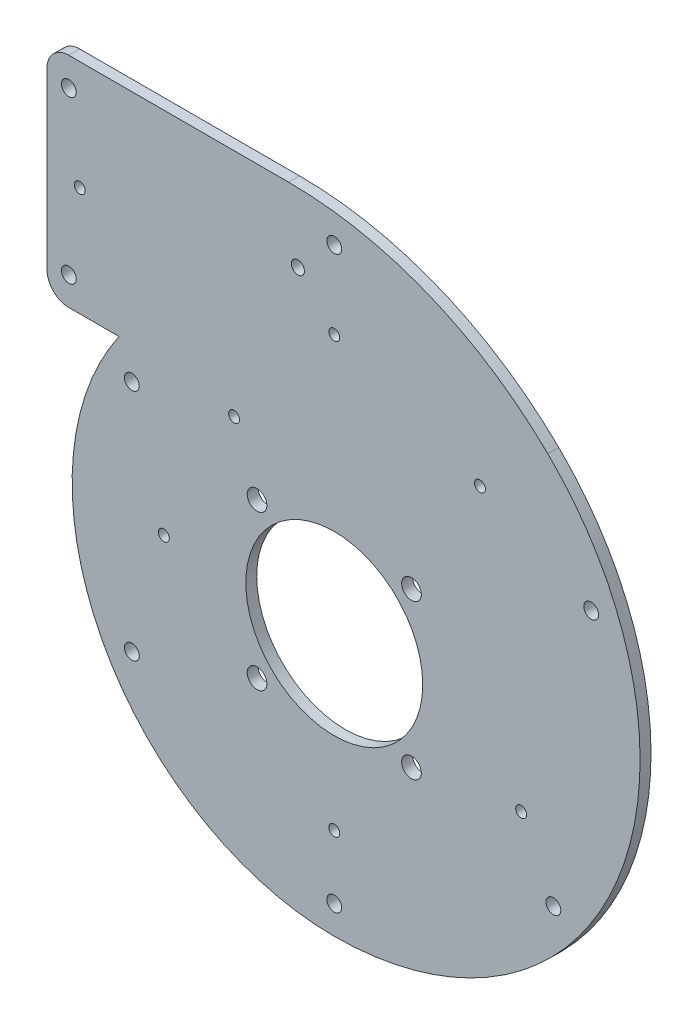
ISO-10303-21;
HEADER;
FILE_DESCRIPTION(('STEP AP214'),'2;1');
FILE_NAME('part.step','',(''),(''),'','','');
FILE_SCHEMA(('AUTOMOTIVE_DESIGN { 1 0 10303 214 1 1 1 1 }'));
ENDSEC;
DATA;
#1=APPLICATION_CONTEXT('core data for automotive mechanical design processes');
#2=APPLICATION_PROTOCOL_DEFINITION('international standard','automotive_design',2000,#1);
#3=PRODUCT_CONTEXT('',#1,'mechanical');
#4=PRODUCT('Part','Part','',(#3));
#5=PRODUCT_RELATED_PRODUCT_CATEGORY('part','',(#4));
#6=PRODUCT_DEFINITION_FORMATION('','',#4);
#7=PRODUCT_DEFINITION_CONTEXT('part definition',#1,'design');
#8=PRODUCT_DEFINITION('design','',#6,#7);
#9=PRODUCT_DEFINITION_SHAPE('','',#8);
#10=(LENGTH_UNIT() NAMED_UNIT(*) SI_UNIT(.MILLI.,.METRE.));
#11=(NAMED_UNIT(*) PLANE_ANGLE_UNIT() SI_UNIT($,.RADIAN.));
#12=(NAMED_UNIT(*) SI_UNIT($,.STERADIAN.) SOLID_ANGLE_UNIT());
#13=UNCERTAINTY_MEASURE_WITH_UNIT(LENGTH_MEASURE(1.E-05),#10,'distance_accuracy_value','');
#14=(GEOMETRIC_REPRESENTATION_CONTEXT(3) GLOBAL_UNCERTAINTY_ASSIGNED_CONTEXT((#13)) GLOBAL_UNIT_ASSIGNED_CONTEXT((#10,
#11,#12)) REPRESENTATION_CONTEXT('',''));
#15=CARTESIAN_POINT('',(0.,0.,0.));
#16=DIRECTION('',(0.,0.,1.));
#17=DIRECTION('',(1.,0.,0.));
#18=AXIS2_PLACEMENT_3D('',#15,#16,#17);
#19=CARTESIAN_POINT('',(0.,0.,5.));
#20=DIRECTION('',(0.,0.,-1.));
#21=DIRECTION('',(-1.,0.,0.));
#22=AXIS2_PLACEMENT_3D('',#19,#20,#21);
#23=CYLINDRICAL_SURFACE('',#22,120.);
#24=CARTESIAN_POINT('',(0.,0.,0.));
#25=DIRECTION('',(0.,0.,1.));
#26=DIRECTION('',(1.,0.,0.));
#27=AXIS2_PLACEMENT_3D('',#24,#25,#26);
#28=CIRCLE('',#27,120.);
#29=CARTESIAN_POINT('',(-98.5074602412599,68.5294117647059,0.));
#30=VERTEX_POINT('',#29);
#31=CARTESIAN_POINT('',(0.,-120.,0.));
#32=VERTEX_POINT('',#31);
#33=EDGE_CURVE('E125',#30,#32,#28,.T.);
#34=ORIENTED_EDGE('',*,*,#33,.T.);
#35=DIRECTION('',(0.,0.,-1.));
#36=VECTOR('',#35,1.);
#37=CARTESIAN_POINT('',(0.,-120.,5.));
#38=LINE('',#37,#36);
#39=CARTESIAN_POINT('',(0.,-120.,5.));
#40=VERTEX_POINT('',#39);
#41=EDGE_CURVE('E123',#40,#32,#38,.T.);
#42=ORIENTED_EDGE('',*,*,#41,.F.);
#43=CARTESIAN_POINT('',(0.,0.,5.));
#44=DIRECTION('',(0.,0.,1.));
#45=DIRECTION('',(-1.,0.,0.));
#46=AXIS2_PLACEMENT_3D('',#43,#44,#45);
#47=CIRCLE('',#46,120.);
#48=CARTESIAN_POINT('',(-98.5074602412599,68.5294117647059,5.));
#49=VERTEX_POINT('',#48);
#50=EDGE_CURVE('E108',#49,#40,#47,.T.);
#51=ORIENTED_EDGE('',*,*,#50,.F.);
#52=DIRECTION('',(0.,0.,-1.));
#53=VECTOR('',#52,1.);
#54=CARTESIAN_POINT('',(-98.5074602412599,68.5294117647059,5.));
#55=LINE('',#54,#53);
#56=EDGE_CURVE('E155',#49,#30,#55,.T.);
#57=ORIENTED_EDGE('',*,*,#56,.T.);
#58=EDGE_LOOP('',(#34,#42,#51,#57));
#59=FACE_BOUND('',#58,.T.);
#60=ADVANCED_FACE('F39',(#59),#23,.T.);
#61=CARTESIAN_POINT('',(0.,20.,5.));
#62=DIRECTION('',(0.,0.,-1.));
#63=DIRECTION('',(-1.,0.,0.));
#64=AXIS2_PLACEMENT_3D('',#61,#62,#63);
#65=CYLINDRICAL_SURFACE('',#64,140.);
#66=CARTESIAN_POINT('',(0.,20.,0.));
#67=DIRECTION('',(0.,0.,1.));
#68=DIRECTION('',(1.,0.,0.));
#69=AXIS2_PLACEMENT_3D('',#66,#67,#68);
#70=CIRCLE('',#69,140.);
#71=CARTESIAN_POINT('',(97.7790666092403,120.196078431373,0.));
#72=VERTEX_POINT('',#71);
#73=EDGE_CURVE('E408',#32,#72,#70,.T.);
#74=ORIENTED_EDGE('',*,*,#73,.T.);
#75=DIRECTION('',(0.,0.,-1.));
#76=VECTOR('',#75,1.);
#77=CARTESIAN_POINT('',(97.7790666092403,120.196078431373,5.));
#78=LINE('',#77,#76);
#79=CARTESIAN_POINT('',(97.7790666092403,120.196078431373,5.));
#80=VERTEX_POINT('',#79);
#81=EDGE_CURVE('E129',#80,#72,#78,.T.);
#82=ORIENTED_EDGE('',*,*,#81,.F.);
#83=CARTESIAN_POINT('',(0.,20.,5.));
#84=DIRECTION('',(0.,0.,1.));
#85=DIRECTION('',(1.,0.,0.));
#86=AXIS2_PLACEMENT_3D('',#83,#84,#85);
#87=CIRCLE('',#86,140.);
#88=EDGE_CURVE('E114',#40,#80,#87,.T.);
#89=ORIENTED_EDGE('',*,*,#88,.F.);
#90=ORIENTED_EDGE('',*,*,#41,.T.);
#91=EDGE_LOOP('',(#74,#82,#89,#90));
#92=FACE_BOUND('',#91,.T.);
#93=ADVANCED_FACE('F131',(#92),#65,.T.);
#94=CARTESIAN_POINT('',(-20.9526571305515,-1.47058823529413,5.));
#95=DIRECTION('',(0.,0.,-1.));
#96=DIRECTION('',(-1.,0.,0.));
#97=AXIS2_PLACEMENT_3D('',#94,#95,#96);
#98=CYLINDRICAL_SURFACE('',#97,170.);
#99=CARTESIAN_POINT('',(-20.9526571305515,-1.47058823529413,0.));
#100=DIRECTION('',(0.,0.,1.));
#101=DIRECTION('',(1.,0.,0.));
#102=AXIS2_PLACEMENT_3D('',#99,#100,#101);
#103=CIRCLE('',#102,170.);
#104=CARTESIAN_POINT('',(-20.9526571305515,168.529411764706,0.));
#105=VERTEX_POINT('',#104);
#106=EDGE_CURVE('E401',#72,#105,#103,.T.);
#107=ORIENTED_EDGE('',*,*,#106,.T.);
#108=DIRECTION('',(0.,0.,-1.));
#109=VECTOR('',#108,1.);
#110=CARTESIAN_POINT('',(-20.9526571305515,168.529411764706,5.));
#111=LINE('',#110,#109);
#112=CARTESIAN_POINT('',(-20.9526571305515,168.529411764706,5.));
#113=VERTEX_POINT('',#112);
#114=EDGE_CURVE('E399',#113,#105,#111,.T.);
#115=ORIENTED_EDGE('',*,*,#114,.F.);
#116=CARTESIAN_POINT('',(-20.9526571305515,-1.47058823529413,5.));
#117=DIRECTION('',(0.,0.,1.));
#118=DIRECTION('',(1.,0.,0.));
#119=AXIS2_PLACEMENT_3D('',#116,#117,#118);
#120=CIRCLE('',#119,170.);
#121=EDGE_CURVE('E134',#80,#113,#120,.T.);
#122=ORIENTED_EDGE('',*,*,#121,.F.);
#123=ORIENTED_EDGE('',*,*,#81,.T.);
#124=EDGE_LOOP('',(#107,#115,#122,#123));
#125=FACE_BOUND('',#124,.T.);
#126=ADVANCED_FACE('F373',(#125),#98,.T.);
#127=CARTESIAN_POINT('',(-20.9526571305515,168.529411764706,5.));
#128=DIRECTION('',(0.,-1.,0.));
#129=DIRECTION('',(0.,0.,-1.));
#130=AXIS2_PLACEMENT_3D('',#127,#128,#129);
#131=PLANE('',#130);
#132=DIRECTION('',(-1.,0.,0.));
#133=VECTOR('',#132,1.);
#134=CARTESIAN_POINT('',(-20.9526571305515,168.529411764706,0.));
#135=LINE('',#134,#133);
#136=CARTESIAN_POINT('',(-121.503153146805,168.529411764706,0.));
#137=VERTEX_POINT('',#136);
#138=EDGE_CURVE('E396',#105,#137,#135,.T.);
#139=ORIENTED_EDGE('',*,*,#138,.T.);
#140=DIRECTION('',(0.,0.,1.));
#141=VECTOR('',#140,1.);
#142=CARTESIAN_POINT('',(-121.503153146805,168.529411764706,5.));
#143=LINE('',#142,#141);
#144=CARTESIAN_POINT('',(-121.503153146805,168.529411764706,5.));
#145=VERTEX_POINT('',#144);
#146=EDGE_CURVE('E12',#137,#145,#143,.T.);
#147=ORIENTED_EDGE('',*,*,#146,.T.);
#148=DIRECTION('',(-1.,0.,0.));
#149=VECTOR('',#148,1.);
#150=CARTESIAN_POINT('',(-20.9526571305515,168.529411764706,5.));
#151=LINE('',#150,#149);
#152=EDGE_CURVE('E136',#113,#145,#151,.T.);
#153=ORIENTED_EDGE('',*,*,#152,.F.);
#154=ORIENTED_EDGE('',*,*,#114,.T.);
#155=EDGE_LOOP('',(#139,#147,#153,#154));
#156=FACE_BOUND('',#155,.T.);
#157=ADVANCED_FACE('F394',(#156),#131,.F.);
#158=CARTESIAN_POINT('',(-98.5074602412599,68.5294117647059,5.));
#159=DIRECTION('',(0.,1.,0.));
#160=DIRECTION('',(0.,0.,1.));
#161=AXIS2_PLACEMENT_3D('',#158,#159,#160);
#162=PLANE('',#161);
#163=DIRECTION('',(1.,0.,0.));
#164=VECTOR('',#163,1.);
#165=CARTESIAN_POINT('',(-98.5074602412599,68.5294117647059,5.));
#166=LINE('',#165,#164);
#167=CARTESIAN_POINT('',(-121.503153146805,68.5294117647059,5.));
#168=VERTEX_POINT('',#167);
#169=EDGE_CURVE('E116',#168,#49,#166,.T.);
#170=ORIENTED_EDGE('',*,*,#169,.F.);
#171=DIRECTION('',(0.,0.,1.));
#172=VECTOR('',#171,1.);
#173=CARTESIAN_POINT('',(-121.503153146805,68.5294117647059,5.));
#174=LINE('',#173,#172);
#175=CARTESIAN_POINT('',(-121.503153146805,68.5294117647059,0.));
#176=VERTEX_POINT('',#175);
#177=EDGE_CURVE('E64',#168,#176,#174,.F.);
#178=ORIENTED_EDGE('',*,*,#177,.T.);
#179=DIRECTION('',(1.,0.,0.));
#180=VECTOR('',#179,1.);
#181=CARTESIAN_POINT('',(-98.5074602412599,68.5294117647059,0.));
#182=LINE('',#181,#180);
#183=EDGE_CURVE('E120',#176,#30,#182,.T.);
#184=ORIENTED_EDGE('',*,*,#183,.T.);
#185=ORIENTED_EDGE('',*,*,#56,.F.);
#186=EDGE_LOOP('',(#170,#178,#184,#185));
#187=FACE_BOUND('',#186,.T.);
#188=ADVANCED_FACE('F409',(#187),#162,.F.);
#189=CARTESIAN_POINT('',(0.,0.,5.));
#190=DIRECTION('',(0.,0.,-1.));
#191=DIRECTION('',(-1.,0.,0.));
#192=AXIS2_PLACEMENT_3D('',#189,#190,#191);
#193=PLANE('',#192);
#194=CARTESIAN_POINT('',(-116.503153146804,118.529411764706,5.));
#195=DIRECTION('',(0.,0.,1.));
#196=DIRECTION('',(1.,0.,0.));
#197=AXIS2_PLACEMENT_3D('',#194,#195,#196);
#198=CIRCLE('',#197,2.50000000000001);
#199=CARTESIAN_POINT('',(-114.003153146804,118.529411764706,5.));
#200=VERTEX_POINT('',#199);
#201=EDGE_CURVE('E705',#200,#200,#198,.T.);
#202=ORIENTED_EDGE('',*,*,#201,.F.);
#203=EDGE_LOOP('',(#202));
#204=FACE_BOUND('',#203,.T.);
#205=CARTESIAN_POINT('',(-78.,0.,5.));
#206=DIRECTION('',(0.,0.,1.));
#207=DIRECTION('',(1.,0.,0.));
#208=AXIS2_PLACEMENT_3D('',#205,#206,#207);
#209=CIRCLE('',#208,2.5);
#210=CARTESIAN_POINT('',(-75.5,0.,5.));
#211=VERTEX_POINT('',#210);
#212=EDGE_CURVE('E702',#211,#211,#209,.T.);
#213=ORIENTED_EDGE('',*,*,#212,.F.);
#214=EDGE_LOOP('',(#213));
#215=FACE_BOUND('',#214,.T.);
#216=CARTESIAN_POINT('',(-45.8472496788129,63.1033255612459,5.));
#217=DIRECTION('',(0.,0.,1.));
#218=DIRECTION('',(1.,0.,0.));
#219=AXIS2_PLACEMENT_3D('',#216,#217,#218);
#220=CIRCLE('',#219,2.5);
#221=CARTESIAN_POINT('',(-43.3472496788129,63.1033255612459,5.));
#222=VERTEX_POINT('',#221);
#223=EDGE_CURVE('E704',#222,#222,#220,.T.);
#224=ORIENTED_EDGE('',*,*,#223,.F.);
#225=EDGE_LOOP('',(#224));
#226=FACE_BOUND('',#225,.T.);
#227=CARTESIAN_POINT('',(0.,-78.,5.));
#228=DIRECTION('',(0.,0.,1.));
#229=DIRECTION('',(1.,0.,0.));
#230=AXIS2_PLACEMENT_3D('',#227,#228,#229);
#231=CIRCLE('',#230,2.5);
#232=CARTESIAN_POINT('',(2.49999999999998,-78.,5.));
#233=VERTEX_POINT('',#232);
#234=EDGE_CURVE('E708',#233,#233,#231,.T.);
#235=ORIENTED_EDGE('',*,*,#234,.F.);
#236=EDGE_LOOP('',(#235));
#237=FACE_BOUND('',#236,.T.);
#238=CARTESIAN_POINT('',(85.5532437102211,-27.7979339580648,5.));
#239=DIRECTION('',(0.,0.,1.));
#240=DIRECTION('',(1.,0.,0.));
#241=AXIS2_PLACEMENT_3D('',#238,#239,#240);
#242=CIRCLE('',#241,2.5);
#243=CARTESIAN_POINT('',(88.0532437102211,-27.7979339580648,5.));
#244=VERTEX_POINT('',#243);
#245=EDGE_CURVE('E723',#244,#244,#242,.T.);
#246=ORIENTED_EDGE('',*,*,#245,.F.);
#247=EDGE_LOOP('',(#246));
#248=FACE_BOUND('',#247,.T.);
#249=CARTESIAN_POINT('',(66.7017060349526,91.8070222510918,5.));
#250=DIRECTION('',(0.,0.,1.));
#251=DIRECTION('',(1.,0.,0.));
#252=AXIS2_PLACEMENT_3D('',#249,#250,#251);
#253=CIRCLE('',#252,2.50000000000001);
#254=CARTESIAN_POINT('',(69.2017060349526,91.8070222510918,5.));
#255=VERTEX_POINT('',#254);
#256=EDGE_CURVE('E727',#255,#255,#253,.T.);
#257=ORIENTED_EDGE('',*,*,#256,.F.);
#258=EDGE_LOOP('',(#257));
#259=FACE_BOUND('',#258,.T.);
#260=CARTESIAN_POINT('',(0.,118.529411764706,5.));
#261=DIRECTION('',(0.,0.,1.));
#262=DIRECTION('',(1.,0.,0.));
#263=AXIS2_PLACEMENT_3D('',#260,#261,#262);
#264=CIRCLE('',#263,2.5);
#265=CARTESIAN_POINT('',(2.49999999999999,118.529411764706,5.));
#266=VERTEX_POINT('',#265);
#267=EDGE_CURVE('E167',#266,#266,#264,.T.);
#268=ORIENTED_EDGE('',*,*,#267,.F.);
#269=EDGE_LOOP('',(#268));
#270=FACE_BOUND('',#269,.T.);
#271=DIRECTION('',(0.,1.,0.));
#272=VECTOR('',#271,1.);
#273=CARTESIAN_POINT('',(-131.503153146805,168.529411764706,5.));
#274=LINE('',#273,#272);
#275=CARTESIAN_POINT('',(-131.503153146804,78.5294117647059,5.));
#276=VERTEX_POINT('',#275);
#277=CARTESIAN_POINT('',(-131.503153146805,158.529411764706,5.));
#278=VERTEX_POINT('',#277);
#279=EDGE_CURVE('E162',#276,#278,#274,.T.);
#280=ORIENTED_EDGE('',*,*,#279,.F.);
#281=CARTESIAN_POINT('',(-121.503153146805,78.5294117647059,5.));
#282=DIRECTION('',(0.,0.,-1.));
#283=DIRECTION('',(-1.,0.,0.));
#284=AXIS2_PLACEMENT_3D('',#281,#282,#283);
#285=CIRCLE('',#284,10.);
#286=EDGE_CURVE('E286',#276,#168,#285,.F.);
#287=ORIENTED_EDGE('',*,*,#286,.T.);
#288=ORIENTED_EDGE('',*,*,#169,.T.);
#289=ORIENTED_EDGE('',*,*,#50,.T.);
#290=ORIENTED_EDGE('',*,*,#88,.T.);
#291=ORIENTED_EDGE('',*,*,#121,.T.);
#292=ORIENTED_EDGE('',*,*,#152,.T.);
#293=CARTESIAN_POINT('',(-121.503153146805,158.529411764706,5.));
#294=DIRECTION('',(0.,0.,-1.));
#295=DIRECTION('',(-1.,0.,0.));
#296=AXIS2_PLACEMENT_3D('',#293,#294,#295);
#297=CIRCLE('',#296,10.);
#298=EDGE_CURVE('E284',#145,#278,#297,.F.);
#299=ORIENTED_EDGE('',*,*,#298,.T.);
#300=EDGE_LOOP('',(#280,#287,#288,#289,#290,#291,#292,#299));
#301=FACE_BOUND('',#300,.T.);
#302=CARTESIAN_POINT('',(-121.503153146805,81.5294117647059,5.));
#303=DIRECTION('',(0.,0.,1.));
#304=DIRECTION('',(1.,0.,0.));
#305=AXIS2_PLACEMENT_3D('',#302,#303,#304);
#306=CIRCLE('',#305,3.4);
#307=CARTESIAN_POINT('',(-118.103153146805,81.5294117647059,5.));
#308=VERTEX_POINT('',#307);
#309=EDGE_CURVE('E216',#308,#308,#306,.T.);
#310=ORIENTED_EDGE('',*,*,#309,.F.);
#311=EDGE_LOOP('',(#310));
#312=FACE_BOUND('',#311,.T.);
#313=CARTESIAN_POINT('',(-92.664718204935,53.5,5.));
#314=DIRECTION('',(0.,0.,1.));
#315=DIRECTION('',(1.,0.,0.));
#316=AXIS2_PLACEMENT_3D('',#313,#314,#315);
#317=CIRCLE('',#316,3.4);
#318=CARTESIAN_POINT('',(-89.264718204935,53.5,5.));
#319=VERTEX_POINT('',#318);
#320=EDGE_CURVE('E213',#319,#319,#317,.T.);
#321=ORIENTED_EDGE('',*,*,#320,.F.);
#322=EDGE_LOOP('',(#321));
#323=FACE_BOUND('',#322,.T.);
#324=CARTESIAN_POINT('',(-92.664718204935,-53.5,5.));
#325=DIRECTION('',(0.,0.,1.));
#326=DIRECTION('',(1.,0.,0.));
#327=AXIS2_PLACEMENT_3D('',#324,#325,#326);
#328=CIRCLE('',#327,3.4);
#329=CARTESIAN_POINT('',(-89.264718204935,-53.5,5.));
#330=VERTEX_POINT('',#329);
#331=EDGE_CURVE('E209',#330,#330,#328,.T.);
#332=ORIENTED_EDGE('',*,*,#331,.F.);
#333=EDGE_LOOP('',(#332));
#334=FACE_BOUND('',#333,.T.);
#335=CARTESIAN_POINT('',(0.,-107.,5.));
#336=DIRECTION('',(0.,0.,1.));
#337=DIRECTION('',(1.,0.,0.));
#338=AXIS2_PLACEMENT_3D('',#335,#336,#337);
#339=CIRCLE('',#338,3.4);
#340=CARTESIAN_POINT('',(3.39999999999997,-107.,5.));
#341=VERTEX_POINT('',#340);
#342=EDGE_CURVE('E205',#341,#341,#339,.T.);
#343=ORIENTED_EDGE('',*,*,#342,.F.);
#344=EDGE_LOOP('',(#343));
#345=FACE_BOUND('',#344,.T.);
#346=CARTESIAN_POINT('',(100.297306507535,-57.9066769111197,5.));
#347=DIRECTION('',(0.,0.,1.));
#348=DIRECTION('',(1.,0.,0.));
#349=AXIS2_PLACEMENT_3D('',#346,#347,#348);
#350=CIRCLE('',#349,3.4);
#351=CARTESIAN_POINT('',(103.697306507535,-57.9066769111197,5.));
#352=VERTEX_POINT('',#351);
#353=EDGE_CURVE('E202',#352,#352,#350,.T.);
#354=ORIENTED_EDGE('',*,*,#353,.F.);
#355=EDGE_LOOP('',(#354));
#356=FACE_BOUND('',#355,.T.);
#357=CARTESIAN_POINT('',(117.617814583224,67.9066769111197,5.));
#358=DIRECTION('',(0.,0.,1.));
#359=DIRECTION('',(1.,0.,0.));
#360=AXIS2_PLACEMENT_3D('',#357,#358,#359);
#361=CIRCLE('',#360,3.4);
#362=CARTESIAN_POINT('',(121.017814583224,67.9066769111197,5.));
#363=VERTEX_POINT('',#362);
#364=EDGE_CURVE('E194',#363,#363,#361,.T.);
#365=ORIENTED_EDGE('',*,*,#364,.F.);
#366=EDGE_LOOP('',(#365));
#367=FACE_BOUND('',#366,.T.);
#368=CARTESIAN_POINT('',(0.,154.124997046453,5.));
#369=DIRECTION('',(0.,0.,1.));
#370=DIRECTION('',(1.,0.,0.));
#371=AXIS2_PLACEMENT_3D('',#368,#369,#370);
#372=CIRCLE('',#371,3.4);
#373=CARTESIAN_POINT('',(3.4,154.124997046453,5.));
#374=VERTEX_POINT('',#373);
#375=EDGE_CURVE('E189',#374,#374,#372,.T.);
#376=ORIENTED_EDGE('',*,*,#375,.F.);
#377=EDGE_LOOP('',(#376));
#378=FACE_BOUND('',#377,.T.);
#379=CARTESIAN_POINT('',(-121.503153146805,155.529411764706,5.));
#380=DIRECTION('',(0.,0.,1.));
#381=DIRECTION('',(1.,0.,0.));
#382=AXIS2_PLACEMENT_3D('',#379,#380,#381);
#383=CIRCLE('',#382,3.4);
#384=CARTESIAN_POINT('',(-118.103153146805,155.529411764706,5.));
#385=VERTEX_POINT('',#384);
#386=EDGE_CURVE('E193',#385,#385,#383,.T.);
#387=ORIENTED_EDGE('',*,*,#386,.F.);
#388=EDGE_LOOP('',(#387));
#389=FACE_BOUND('',#388,.T.);
#390=CARTESIAN_POINT('',(-35.3553390593274,35.3553390593273,5.));
#391=DIRECTION('',(0.,0.,1.));
#392=DIRECTION('',(0.,1.,0.));
#393=AXIS2_PLACEMENT_3D('',#390,#391,#392);
#394=CIRCLE('',#393,4.5);
#395=CARTESIAN_POINT('',(-35.3553390593275,39.8553390593273,5.));
#396=VERTEX_POINT('',#395);
#397=EDGE_CURVE('E170',#396,#396,#394,.T.);
#398=ORIENTED_EDGE('',*,*,#397,.F.);
#399=EDGE_LOOP('',(#398));
#400=FACE_BOUND('',#399,.T.);
#401=CARTESIAN_POINT('',(-35.3553390593274,-35.3553390593273,5.));
#402=DIRECTION('',(0.,0.,1.));
#403=DIRECTION('',(-1.,0.,0.));
#404=AXIS2_PLACEMENT_3D('',#401,#402,#403);
#405=CIRCLE('',#404,4.5);
#406=CARTESIAN_POINT('',(-39.8553390593274,-35.3553390593273,5.));
#407=VERTEX_POINT('',#406);
#408=EDGE_CURVE('E175',#407,#407,#405,.T.);
#409=ORIENTED_EDGE('',*,*,#408,.F.);
#410=EDGE_LOOP('',(#409));
#411=FACE_BOUND('',#410,.T.);
#412=CARTESIAN_POINT('',(35.3553390593277,-35.3553390593271,5.));
#413=DIRECTION('',(0.,0.,1.));
#414=DIRECTION('',(0.,-1.,0.));
#415=AXIS2_PLACEMENT_3D('',#412,#413,#414);
#416=CIRCLE('',#415,4.5);
#417=CARTESIAN_POINT('',(35.3553390593277,-39.8553390593271,5.));
#418=VERTEX_POINT('',#417);
#419=EDGE_CURVE('E166',#418,#418,#416,.T.);
#420=ORIENTED_EDGE('',*,*,#419,.F.);
#421=EDGE_LOOP('',(#420));
#422=FACE_BOUND('',#421,.T.);
#423=CARTESIAN_POINT('',(-16.6560379642934,136.868437771492,5.));
#424=DIRECTION('',(0.,0.,-1.));
#425=DIRECTION('',(-1.,0.,0.));
#426=AXIS2_PLACEMENT_3D('',#423,#424,#425);
#427=CIRCLE('',#426,3.);
#428=CARTESIAN_POINT('',(-19.6560379642934,136.868437771492,5.));
#429=VERTEX_POINT('',#428);
#430=EDGE_CURVE('E223',#429,#429,#427,.T.);
#431=ORIENTED_EDGE('',*,*,#430,.T.);
#432=EDGE_LOOP('',(#431));
#433=FACE_BOUND('',#432,.T.);
#434=CARTESIAN_POINT('',(0.,0.,5.));
#435=DIRECTION('',(0.,0.,1.));
#436=DIRECTION('',(1.,0.,0.));
#437=AXIS2_PLACEMENT_3D('',#434,#435,#436);
#438=CIRCLE('',#437,40.5);
#439=CARTESIAN_POINT('',(40.5,0.,5.));
#440=VERTEX_POINT('',#439);
#441=EDGE_CURVE('E227',#440,#440,#438,.T.);
#442=ORIENTED_EDGE('',*,*,#441,.F.);
#443=EDGE_LOOP('',(#442));
#444=FACE_BOUND('',#443,.T.);
#445=CARTESIAN_POINT('',(35.3553390593274,35.3553390593273,5.));
#446=DIRECTION('',(0.,0.,1.));
#447=DIRECTION('',(1.,0.,0.));
#448=AXIS2_PLACEMENT_3D('',#445,#446,#447);
#449=CIRCLE('',#448,4.5);
#450=CARTESIAN_POINT('',(39.8553390593274,35.3553390593273,5.));
#451=VERTEX_POINT('',#450);
#452=EDGE_CURVE('E235',#451,#451,#449,.T.);
#453=ORIENTED_EDGE('',*,*,#452,.F.);
#454=EDGE_LOOP('',(#453));
#455=FACE_BOUND('',#454,.T.);
#456=ADVANCED_FACE('F111',(#204,#215,#226,#237,#248,#259,#270,#301,#312,#323,#334,#345,#356,
#367,#378,#389,#400,#411,#422,#433,#444,#455),#193,.F.);
#457=CARTESIAN_POINT('',(0.,0.,0.));
#458=DIRECTION('',(0.,0.,-1.));
#459=DIRECTION('',(-1.,0.,0.));
#460=AXIS2_PLACEMENT_3D('',#457,#458,#459);
#461=PLANE('',#460);
#462=CARTESIAN_POINT('',(-116.503153146804,118.529411764706,0.));
#463=DIRECTION('',(0.,0.,-1.));
#464=DIRECTION('',(-1.,0.,0.));
#465=AXIS2_PLACEMENT_3D('',#462,#463,#464);
#466=CIRCLE('',#465,2.50000000000001);
#467=CARTESIAN_POINT('',(-119.003153146805,118.529411764706,0.));
#468=VERTEX_POINT('',#467);
#469=EDGE_CURVE('E43',#468,#468,#466,.T.);
#470=ORIENTED_EDGE('',*,*,#469,.F.);
#471=EDGE_LOOP('',(#470));
#472=FACE_BOUND('',#471,.T.);
#473=CARTESIAN_POINT('',(-78.,0.,0.));
#474=DIRECTION('',(0.,0.,-1.));
#475=DIRECTION('',(-1.,0.,0.));
#476=AXIS2_PLACEMENT_3D('',#473,#474,#475);
#477=CIRCLE('',#476,2.5);
#478=CARTESIAN_POINT('',(-80.5,0.,0.));
#479=VERTEX_POINT('',#478);
#480=EDGE_CURVE('E305',#479,#479,#477,.T.);
#481=ORIENTED_EDGE('',*,*,#480,.F.);
#482=EDGE_LOOP('',(#481));
#483=FACE_BOUND('',#482,.T.);
#484=CARTESIAN_POINT('',(-45.8472496788129,63.1033255612459,0.));
#485=DIRECTION('',(0.,0.,-1.));
#486=DIRECTION('',(-1.,0.,0.));
#487=AXIS2_PLACEMENT_3D('',#484,#485,#486);
#488=CIRCLE('',#487,2.5);
#489=CARTESIAN_POINT('',(-48.3472496788129,63.1033255612459,0.));
#490=VERTEX_POINT('',#489);
#491=EDGE_CURVE('E303',#490,#490,#488,.T.);
#492=ORIENTED_EDGE('',*,*,#491,.F.);
#493=EDGE_LOOP('',(#492));
#494=FACE_BOUND('',#493,.T.);
#495=CARTESIAN_POINT('',(0.,-78.,0.));
#496=DIRECTION('',(0.,0.,-1.));
#497=DIRECTION('',(-1.,0.,0.));
#498=AXIS2_PLACEMENT_3D('',#495,#496,#497);
#499=CIRCLE('',#498,2.5);
#500=CARTESIAN_POINT('',(-2.50000000000002,-78.,0.));
#501=VERTEX_POINT('',#500);
#502=EDGE_CURVE('E300',#501,#501,#499,.T.);
#503=ORIENTED_EDGE('',*,*,#502,.F.);
#504=EDGE_LOOP('',(#503));
#505=FACE_BOUND('',#504,.T.);
#506=CARTESIAN_POINT('',(85.5532437102211,-27.7979339580648,0.));
#507=DIRECTION('',(0.,0.,-1.));
#508=DIRECTION('',(-1.,0.,0.));
#509=AXIS2_PLACEMENT_3D('',#506,#507,#508);
#510=CIRCLE('',#509,2.5);
#511=CARTESIAN_POINT('',(83.0532437102211,-27.7979339580648,0.));
#512=VERTEX_POINT('',#511);
#513=EDGE_CURVE('E297',#512,#512,#510,.T.);
#514=ORIENTED_EDGE('',*,*,#513,.F.);
#515=EDGE_LOOP('',(#514));
#516=FACE_BOUND('',#515,.T.);
#517=CARTESIAN_POINT('',(66.7017060349526,91.8070222510918,0.));
#518=DIRECTION('',(0.,0.,-1.));
#519=DIRECTION('',(-1.,0.,0.));
#520=AXIS2_PLACEMENT_3D('',#517,#518,#519);
#521=CIRCLE('',#520,2.50000000000001);
#522=CARTESIAN_POINT('',(64.2017060349526,91.8070222510918,0.));
#523=VERTEX_POINT('',#522);
#524=EDGE_CURVE('E294',#523,#523,#521,.T.);
#525=ORIENTED_EDGE('',*,*,#524,.F.);
#526=EDGE_LOOP('',(#525));
#527=FACE_BOUND('',#526,.T.);
#528=CARTESIAN_POINT('',(0.,118.529411764706,0.));
#529=DIRECTION('',(0.,0.,-1.));
#530=DIRECTION('',(-1.,0.,0.));
#531=AXIS2_PLACEMENT_3D('',#528,#529,#530);
#532=CIRCLE('',#531,2.5);
#533=CARTESIAN_POINT('',(-2.5,118.529411764706,0.));
#534=VERTEX_POINT('',#533);
#535=EDGE_CURVE('E291',#534,#534,#532,.T.);
#536=ORIENTED_EDGE('',*,*,#535,.F.);
#537=EDGE_LOOP('',(#536));
#538=FACE_BOUND('',#537,.T.);
#539=ORIENTED_EDGE('',*,*,#183,.F.);
#540=CARTESIAN_POINT('',(-121.503153146805,78.5294117647059,0.));
#541=DIRECTION('',(0.,0.,-1.));
#542=DIRECTION('',(-1.,0.,0.));
#543=AXIS2_PLACEMENT_3D('',#540,#541,#542);
#544=CIRCLE('',#543,10.);
#545=CARTESIAN_POINT('',(-131.503153146804,78.5294117647059,0.));
#546=VERTEX_POINT('',#545);
#547=EDGE_CURVE('E48',#176,#546,#544,.T.);
#548=ORIENTED_EDGE('',*,*,#547,.T.);
#549=DIRECTION('',(0.,-1.,0.));
#550=VECTOR('',#549,1.);
#551=CARTESIAN_POINT('',(-131.503153146804,0.,0.));
#552=LINE('',#551,#550);
#553=CARTESIAN_POINT('',(-131.503153146805,158.529411764706,0.));
#554=VERTEX_POINT('',#553);
#555=EDGE_CURVE('E128',#554,#546,#552,.T.);
#556=ORIENTED_EDGE('',*,*,#555,.F.);
#557=CARTESIAN_POINT('',(-121.503153146805,158.529411764706,0.));
#558=DIRECTION('',(0.,0.,-1.));
#559=DIRECTION('',(-1.,0.,0.));
#560=AXIS2_PLACEMENT_3D('',#557,#558,#559);
#561=CIRCLE('',#560,10.);
#562=EDGE_CURVE('E56',#554,#137,#561,.T.);
#563=ORIENTED_EDGE('',*,*,#562,.T.);
#564=ORIENTED_EDGE('',*,*,#138,.F.);
#565=ORIENTED_EDGE('',*,*,#106,.F.);
#566=ORIENTED_EDGE('',*,*,#73,.F.);
#567=ORIENTED_EDGE('',*,*,#33,.F.);
#568=EDGE_LOOP('',(#539,#548,#556,#563,#564,#565,#566,#567));
#569=FACE_BOUND('',#568,.T.);
#570=CARTESIAN_POINT('',(-35.3553390593274,35.3553390593273,0.));
#571=DIRECTION('',(0.,0.,-1.));
#572=DIRECTION('',(-1.,0.,0.));
#573=AXIS2_PLACEMENT_3D('',#570,#571,#572);
#574=CIRCLE('',#573,4.5);
#575=CARTESIAN_POINT('',(-39.8553390593274,35.3553390593273,0.));
#576=VERTEX_POINT('',#575);
#577=EDGE_CURVE('E219',#576,#576,#574,.T.);
#578=ORIENTED_EDGE('',*,*,#577,.F.);
#579=EDGE_LOOP('',(#578));
#580=FACE_BOUND('',#579,.T.);
#581=CARTESIAN_POINT('',(-35.3553390593274,-35.3553390593273,0.));
#582=DIRECTION('',(0.,0.,-1.));
#583=DIRECTION('',(-1.,0.,0.));
#584=AXIS2_PLACEMENT_3D('',#581,#582,#583);
#585=CIRCLE('',#584,4.5);
#586=CARTESIAN_POINT('',(-39.8553390593274,-35.3553390593273,0.));
#587=VERTEX_POINT('',#586);
#588=EDGE_CURVE('E272',#587,#587,#585,.T.);
#589=ORIENTED_EDGE('',*,*,#588,.F.);
#590=EDGE_LOOP('',(#589));
#591=FACE_BOUND('',#590,.T.);
#592=CARTESIAN_POINT('',(35.3553390593277,-35.3553390593271,0.));
#593=DIRECTION('',(0.,0.,-1.));
#594=DIRECTION('',(-1.,0.,0.));
#595=AXIS2_PLACEMENT_3D('',#592,#593,#594);
#596=CIRCLE('',#595,4.5);
#597=CARTESIAN_POINT('',(30.8553390593277,-35.3553390593271,0.));
#598=VERTEX_POINT('',#597);
#599=EDGE_CURVE('E174',#598,#598,#596,.T.);
#600=ORIENTED_EDGE('',*,*,#599,.F.);
#601=EDGE_LOOP('',(#600));
#602=FACE_BOUND('',#601,.T.);
#603=CARTESIAN_POINT('',(-121.503153146805,81.5294117647059,0.));
#604=DIRECTION('',(0.,0.,-1.));
#605=DIRECTION('',(-1.,0.,0.));
#606=AXIS2_PLACEMENT_3D('',#603,#604,#605);
#607=CIRCLE('',#606,3.4);
#608=CARTESIAN_POINT('',(-124.903153146805,81.5294117647059,0.));
#609=VERTEX_POINT('',#608);
#610=EDGE_CURVE('E231',#609,#609,#607,.T.);
#611=ORIENTED_EDGE('',*,*,#610,.F.);
#612=EDGE_LOOP('',(#611));
#613=FACE_BOUND('',#612,.T.);
#614=CARTESIAN_POINT('',(-92.664718204935,53.5,0.));
#615=DIRECTION('',(0.,0.,-1.));
#616=DIRECTION('',(-1.,0.,0.));
#617=AXIS2_PLACEMENT_3D('',#614,#615,#616);
#618=CIRCLE('',#617,3.4);
#619=CARTESIAN_POINT('',(-96.064718204935,53.5,0.));
#620=VERTEX_POINT('',#619);
#621=EDGE_CURVE('E265',#620,#620,#618,.T.);
#622=ORIENTED_EDGE('',*,*,#621,.F.);
#623=EDGE_LOOP('',(#622));
#624=FACE_BOUND('',#623,.T.);
#625=CARTESIAN_POINT('',(-92.664718204935,-53.5,0.));
#626=DIRECTION('',(0.,0.,-1.));
#627=DIRECTION('',(-1.,0.,0.));
#628=AXIS2_PLACEMENT_3D('',#625,#626,#627);
#629=CIRCLE('',#628,3.4);
#630=CARTESIAN_POINT('',(-96.0647182049349,-53.5,0.));
#631=VERTEX_POINT('',#630);
#632=EDGE_CURVE('E262',#631,#631,#629,.T.);
#633=ORIENTED_EDGE('',*,*,#632,.F.);
#634=EDGE_LOOP('',(#633));
#635=FACE_BOUND('',#634,.T.);
#636=CARTESIAN_POINT('',(0.,-107.,0.));
#637=DIRECTION('',(0.,0.,-1.));
#638=DIRECTION('',(-1.,0.,0.));
#639=AXIS2_PLACEMENT_3D('',#636,#637,#638);
#640=CIRCLE('',#639,3.4);
#641=CARTESIAN_POINT('',(-3.40000000000003,-107.,0.));
#642=VERTEX_POINT('',#641);
#643=EDGE_CURVE('E259',#642,#642,#640,.T.);
#644=ORIENTED_EDGE('',*,*,#643,.F.);
#645=EDGE_LOOP('',(#644));
#646=FACE_BOUND('',#645,.T.);
#647=CARTESIAN_POINT('',(100.297306507535,-57.9066769111197,0.));
#648=DIRECTION('',(0.,0.,-1.));
#649=DIRECTION('',(-1.,0.,0.));
#650=AXIS2_PLACEMENT_3D('',#647,#648,#649);
#651=CIRCLE('',#650,3.4);
#652=CARTESIAN_POINT('',(96.897306507535,-57.9066769111197,0.));
#653=VERTEX_POINT('',#652);
#654=EDGE_CURVE('E256',#653,#653,#651,.T.);
#655=ORIENTED_EDGE('',*,*,#654,.F.);
#656=EDGE_LOOP('',(#655));
#657=FACE_BOUND('',#656,.T.);
#658=CARTESIAN_POINT('',(117.617814583224,67.9066769111197,0.));
#659=DIRECTION('',(0.,0.,-1.));
#660=DIRECTION('',(-1.,0.,0.));
#661=AXIS2_PLACEMENT_3D('',#658,#659,#660);
#662=CIRCLE('',#661,3.4);
#663=CARTESIAN_POINT('',(114.217814583224,67.9066769111197,0.));
#664=VERTEX_POINT('',#663);
#665=EDGE_CURVE('E253',#664,#664,#662,.T.);
#666=ORIENTED_EDGE('',*,*,#665,.F.);
#667=EDGE_LOOP('',(#666));
#668=FACE_BOUND('',#667,.T.);
#669=CARTESIAN_POINT('',(0.,154.124997046453,0.));
#670=DIRECTION('',(0.,0.,-1.));
#671=DIRECTION('',(-1.,0.,0.));
#672=AXIS2_PLACEMENT_3D('',#669,#670,#671);
#673=CIRCLE('',#672,3.4);
#674=CARTESIAN_POINT('',(-3.4,154.124997046453,0.));
#675=VERTEX_POINT('',#674);
#676=EDGE_CURVE('E250',#675,#675,#673,.T.);
#677=ORIENTED_EDGE('',*,*,#676,.F.);
#678=EDGE_LOOP('',(#677));
#679=FACE_BOUND('',#678,.T.);
#680=CARTESIAN_POINT('',(-121.503153146805,155.529411764706,0.));
#681=DIRECTION('',(0.,0.,-1.));
#682=DIRECTION('',(-1.,0.,0.));
#683=AXIS2_PLACEMENT_3D('',#680,#681,#682);
#684=CIRCLE('',#683,3.4);
#685=CARTESIAN_POINT('',(-124.903153146805,155.529411764706,0.));
#686=VERTEX_POINT('',#685);
#687=EDGE_CURVE('E222',#686,#686,#684,.T.);
#688=ORIENTED_EDGE('',*,*,#687,.F.);
#689=EDGE_LOOP('',(#688));
#690=FACE_BOUND('',#689,.T.);
#691=CARTESIAN_POINT('',(-16.6560379642934,136.868437771492,0.));
#692=DIRECTION('',(0.,0.,-1.));
#693=DIRECTION('',(-1.,0.,0.));
#694=AXIS2_PLACEMENT_3D('',#691,#692,#693);
#695=CIRCLE('',#694,3.);
#696=CARTESIAN_POINT('',(-19.6560379642934,136.868437771492,0.));
#697=VERTEX_POINT('',#696);
#698=EDGE_CURVE('E228',#697,#697,#695,.T.);
#699=ORIENTED_EDGE('',*,*,#698,.F.);
#700=EDGE_LOOP('',(#699));
#701=FACE_BOUND('',#700,.T.);
#702=CARTESIAN_POINT('',(0.,0.,0.));
#703=DIRECTION('',(0.,0.,-1.));
#704=DIRECTION('',(-1.,0.,0.));
#705=AXIS2_PLACEMENT_3D('',#702,#703,#704);
#706=CIRCLE('',#705,40.5);
#707=CARTESIAN_POINT('',(-40.5,0.,0.));
#708=VERTEX_POINT('',#707);
#709=EDGE_CURVE('E234',#708,#708,#706,.T.);
#710=ORIENTED_EDGE('',*,*,#709,.F.);
#711=EDGE_LOOP('',(#710));
#712=FACE_BOUND('',#711,.T.);
#713=CARTESIAN_POINT('',(35.3553390593274,35.3553390593273,0.));
#714=DIRECTION('',(0.,0.,-1.));
#715=DIRECTION('',(-1.,0.,0.));
#716=AXIS2_PLACEMENT_3D('',#713,#714,#715);
#717=CIRCLE('',#716,4.5);
#718=CARTESIAN_POINT('',(30.8553390593274,35.3553390593273,0.));
#719=VERTEX_POINT('',#718);
#720=EDGE_CURVE('E238',#719,#719,#717,.T.);
#721=ORIENTED_EDGE('',*,*,#720,.F.);
#722=EDGE_LOOP('',(#721));
#723=FACE_BOUND('',#722,.T.);
#724=ADVANCED_FACE('F315',(#472,#483,#494,#505,#516,#527,#538,#569,#580,#591,#602,#613,#624,
#635,#646,#657,#668,#679,#690,#701,#712,#723),#461,.T.);
#725=CARTESIAN_POINT('',(35.3553390593274,35.3553390593273,-8.));
#726=DIRECTION('',(0.,0.,1.));
#727=DIRECTION('',(1.,0.,0.));
#728=AXIS2_PLACEMENT_3D('',#725,#726,#727);
#729=CYLINDRICAL_SURFACE('',#728,4.5);
#730=ORIENTED_EDGE('',*,*,#720,.T.);
#731=EDGE_LOOP('',(#730));
#732=FACE_BOUND('',#731,.T.);
#733=ORIENTED_EDGE('',*,*,#452,.T.);
#734=EDGE_LOOP('',(#733));
#735=FACE_BOUND('',#734,.T.);
#736=ADVANCED_FACE('F318',(#732,#735),#729,.F.);
#737=CARTESIAN_POINT('',(0.,0.,-5.));
#738=DIRECTION('',(0.,0.,1.));
#739=DIRECTION('',(1.,0.,0.));
#740=AXIS2_PLACEMENT_3D('',#737,#738,#739);
#741=CYLINDRICAL_SURFACE('',#740,40.5);
#742=ORIENTED_EDGE('',*,*,#709,.T.);
#743=EDGE_LOOP('',(#742));
#744=FACE_BOUND('',#743,.T.);
#745=ORIENTED_EDGE('',*,*,#441,.T.);
#746=EDGE_LOOP('',(#745));
#747=FACE_BOUND('',#746,.T.);
#748=ADVANCED_FACE('F360',(#744,#747),#741,.F.);
#749=CARTESIAN_POINT('',(-16.6560379642934,136.868437771492,5.));
#750=DIRECTION('',(0.,0.,-1.));
#751=DIRECTION('',(-1.,0.,0.));
#752=AXIS2_PLACEMENT_3D('',#749,#750,#751);
#753=CYLINDRICAL_SURFACE('',#752,3.);
#754=ORIENTED_EDGE('',*,*,#430,.F.);
#755=EDGE_LOOP('',(#754));
#756=FACE_BOUND('',#755,.T.);
#757=ORIENTED_EDGE('',*,*,#698,.T.);
#758=EDGE_LOOP('',(#757));
#759=FACE_BOUND('',#758,.T.);
#760=ADVANCED_FACE('F365',(#756,#759),#753,.F.);
#761=CARTESIAN_POINT('',(-121.503153146805,155.529411764706,-8.));
#762=DIRECTION('',(0.,0.,1.));
#763=DIRECTION('',(1.,0.,0.));
#764=AXIS2_PLACEMENT_3D('',#761,#762,#763);
#765=CYLINDRICAL_SURFACE('',#764,3.4);
#766=ORIENTED_EDGE('',*,*,#687,.T.);
#767=EDGE_LOOP('',(#766));
#768=FACE_BOUND('',#767,.T.);
#769=ORIENTED_EDGE('',*,*,#386,.T.);
#770=EDGE_LOOP('',(#769));
#771=FACE_BOUND('',#770,.T.);
#772=ADVANCED_FACE('F552',(#768,#771),#765,.F.);
#773=CARTESIAN_POINT('',(0.,154.124997046453,-8.));
#774=DIRECTION('',(0.,0.,1.));
#775=DIRECTION('',(1.,0.,0.));
#776=AXIS2_PLACEMENT_3D('',#773,#774,#775);
#777=CYLINDRICAL_SURFACE('',#776,3.4);
#778=ORIENTED_EDGE('',*,*,#676,.T.);
#779=EDGE_LOOP('',(#778));
#780=FACE_BOUND('',#779,.T.);
#781=ORIENTED_EDGE('',*,*,#375,.T.);
#782=EDGE_LOOP('',(#781));
#783=FACE_BOUND('',#782,.T.);
#784=ADVANCED_FACE('F548',(#780,#783),#777,.F.);
#785=CARTESIAN_POINT('',(117.617814583224,67.9066769111197,-8.));
#786=DIRECTION('',(0.,0.,1.));
#787=DIRECTION('',(1.,0.,0.));
#788=AXIS2_PLACEMENT_3D('',#785,#786,#787);
#789=CYLINDRICAL_SURFACE('',#788,3.4);
#790=ORIENTED_EDGE('',*,*,#665,.T.);
#791=EDGE_LOOP('',(#790));
#792=FACE_BOUND('',#791,.T.);
#793=ORIENTED_EDGE('',*,*,#364,.T.);
#794=EDGE_LOOP('',(#793));
#795=FACE_BOUND('',#794,.T.);
#796=ADVANCED_FACE('F551',(#792,#795),#789,.F.);
#797=CARTESIAN_POINT('',(100.297306507535,-57.9066769111197,-8.));
#798=DIRECTION('',(0.,0.,1.));
#799=DIRECTION('',(1.,0.,0.));
#800=AXIS2_PLACEMENT_3D('',#797,#798,#799);
#801=CYLINDRICAL_SURFACE('',#800,3.4);
#802=ORIENTED_EDGE('',*,*,#654,.T.);
#803=EDGE_LOOP('',(#802));
#804=FACE_BOUND('',#803,.T.);
#805=ORIENTED_EDGE('',*,*,#353,.T.);
#806=EDGE_LOOP('',(#805));
#807=FACE_BOUND('',#806,.T.);
#808=ADVANCED_FACE('F556',(#804,#807),#801,.F.);
#809=CARTESIAN_POINT('',(0.,-107.,-8.));
#810=DIRECTION('',(0.,0.,1.));
#811=DIRECTION('',(1.,0.,0.));
#812=AXIS2_PLACEMENT_3D('',#809,#810,#811);
#813=CYLINDRICAL_SURFACE('',#812,3.4);
#814=ORIENTED_EDGE('',*,*,#643,.T.);
#815=EDGE_LOOP('',(#814));
#816=FACE_BOUND('',#815,.T.);
#817=ORIENTED_EDGE('',*,*,#342,.T.);
#818=EDGE_LOOP('',(#817));
#819=FACE_BOUND('',#818,.T.);
#820=ADVANCED_FACE('F560',(#816,#819),#813,.F.);
#821=CARTESIAN_POINT('',(-92.664718204935,-53.5,-8.));
#822=DIRECTION('',(0.,0.,1.));
#823=DIRECTION('',(1.,0.,0.));
#824=AXIS2_PLACEMENT_3D('',#821,#822,#823);
#825=CYLINDRICAL_SURFACE('',#824,3.4);
#826=ORIENTED_EDGE('',*,*,#632,.T.);
#827=EDGE_LOOP('',(#826));
#828=FACE_BOUND('',#827,.T.);
#829=ORIENTED_EDGE('',*,*,#331,.T.);
#830=EDGE_LOOP('',(#829));
#831=FACE_BOUND('',#830,.T.);
#832=ADVANCED_FACE('F564',(#828,#831),#825,.F.);
#833=CARTESIAN_POINT('',(-92.664718204935,53.5,-8.));
#834=DIRECTION('',(0.,0.,1.));
#835=DIRECTION('',(1.,0.,0.));
#836=AXIS2_PLACEMENT_3D('',#833,#834,#835);
#837=CYLINDRICAL_SURFACE('',#836,3.4);
#838=ORIENTED_EDGE('',*,*,#621,.T.);
#839=EDGE_LOOP('',(#838));
#840=FACE_BOUND('',#839,.T.);
#841=ORIENTED_EDGE('',*,*,#320,.T.);
#842=EDGE_LOOP('',(#841));
#843=FACE_BOUND('',#842,.T.);
#844=ADVANCED_FACE('F568',(#840,#843),#837,.F.);
#845=CARTESIAN_POINT('',(-121.503153146805,81.5294117647059,-8.));
#846=DIRECTION('',(0.,0.,1.));
#847=DIRECTION('',(1.,0.,0.));
#848=AXIS2_PLACEMENT_3D('',#845,#846,#847);
#849=CYLINDRICAL_SURFACE('',#848,3.4);
#850=ORIENTED_EDGE('',*,*,#610,.T.);
#851=EDGE_LOOP('',(#850));
#852=FACE_BOUND('',#851,.T.);
#853=ORIENTED_EDGE('',*,*,#309,.T.);
#854=EDGE_LOOP('',(#853));
#855=FACE_BOUND('',#854,.T.);
#856=ADVANCED_FACE('F546',(#852,#855),#849,.F.);
#857=CARTESIAN_POINT('',(35.3553390593277,-35.3553390593271,-8.));
#858=DIRECTION('',(0.,0.,1.));
#859=DIRECTION('',(1.,0.,0.));
#860=AXIS2_PLACEMENT_3D('',#857,#858,#859);
#861=CYLINDRICAL_SURFACE('',#860,4.5);
#862=ORIENTED_EDGE('',*,*,#599,.T.);
#863=EDGE_LOOP('',(#862));
#864=FACE_BOUND('',#863,.T.);
#865=ORIENTED_EDGE('',*,*,#419,.T.);
#866=EDGE_LOOP('',(#865));
#867=FACE_BOUND('',#866,.T.);
#868=ADVANCED_FACE('F542',(#864,#867),#861,.F.);
#869=CARTESIAN_POINT('',(-35.3553390593274,-35.3553390593273,-8.));
#870=DIRECTION('',(0.,0.,1.));
#871=DIRECTION('',(1.,0.,0.));
#872=AXIS2_PLACEMENT_3D('',#869,#870,#871);
#873=CYLINDRICAL_SURFACE('',#872,4.5);
#874=ORIENTED_EDGE('',*,*,#588,.T.);
#875=EDGE_LOOP('',(#874));
#876=FACE_BOUND('',#875,.T.);
#877=ORIENTED_EDGE('',*,*,#408,.T.);
#878=EDGE_LOOP('',(#877));
#879=FACE_BOUND('',#878,.T.);
#880=ADVANCED_FACE('F538',(#876,#879),#873,.F.);
#881=CARTESIAN_POINT('',(-35.3553390593274,35.3553390593273,-8.));
#882=DIRECTION('',(0.,0.,1.));
#883=DIRECTION('',(1.,0.,0.));
#884=AXIS2_PLACEMENT_3D('',#881,#882,#883);
#885=CYLINDRICAL_SURFACE('',#884,4.5);
#886=ORIENTED_EDGE('',*,*,#577,.T.);
#887=EDGE_LOOP('',(#886));
#888=FACE_BOUND('',#887,.T.);
#889=ORIENTED_EDGE('',*,*,#397,.T.);
#890=EDGE_LOOP('',(#889));
#891=FACE_BOUND('',#890,.T.);
#892=ADVANCED_FACE('F386',(#888,#891),#885,.F.);
#893=CARTESIAN_POINT('',(-131.503153146805,168.529411764706,-5.));
#894=DIRECTION('',(1.,0.,0.));
#895=DIRECTION('',(0.,1.,0.));
#896=AXIS2_PLACEMENT_3D('',#893,#894,#895);
#897=PLANE('',#896);
#898=ORIENTED_EDGE('',*,*,#555,.T.);
#899=DIRECTION('',(0.,0.,1.));
#900=VECTOR('',#899,1.);
#901=CARTESIAN_POINT('',(-131.503153146804,78.5294117647059,-5.));
#902=LINE('',#901,#900);
#903=EDGE_CURVE('E281',#546,#276,#902,.T.);
#904=ORIENTED_EDGE('',*,*,#903,.T.);
#905=ORIENTED_EDGE('',*,*,#279,.T.);
#906=DIRECTION('',(0.,0.,1.));
#907=VECTOR('',#906,1.);
#908=CARTESIAN_POINT('',(-131.503153146805,158.529411764706,-5.));
#909=LINE('',#908,#907);
#910=EDGE_CURVE('E279',#278,#554,#909,.F.);
#911=ORIENTED_EDGE('',*,*,#910,.T.);
#912=EDGE_LOOP('',(#898,#904,#905,#911));
#913=FACE_BOUND('',#912,.T.);
#914=ADVANCED_FACE('F378',(#913),#897,.F.);
#915=CARTESIAN_POINT('',(-121.503153146805,78.5294117647059,-5.));
#916=DIRECTION('',(0.,0.,1.));
#917=DIRECTION('',(1.,0.,0.));
#918=AXIS2_PLACEMENT_3D('',#915,#916,#917);
#919=CYLINDRICAL_SURFACE('',#918,10.);
#920=ORIENTED_EDGE('',*,*,#547,.F.);
#921=ORIENTED_EDGE('',*,*,#177,.F.);
#922=ORIENTED_EDGE('',*,*,#286,.F.);
#923=ORIENTED_EDGE('',*,*,#903,.F.);
#924=EDGE_LOOP('',(#920,#921,#922,#923));
#925=FACE_BOUND('',#924,.T.);
#926=ADVANCED_FACE('F376',(#925),#919,.T.);
#927=CARTESIAN_POINT('',(-121.503153146805,158.529411764706,5.));
#928=DIRECTION('',(0.,0.,1.));
#929=DIRECTION('',(1.,0.,0.));
#930=AXIS2_PLACEMENT_3D('',#927,#928,#929);
#931=CYLINDRICAL_SURFACE('',#930,10.);
#932=ORIENTED_EDGE('',*,*,#562,.F.);
#933=ORIENTED_EDGE('',*,*,#910,.F.);
#934=ORIENTED_EDGE('',*,*,#298,.F.);
#935=ORIENTED_EDGE('',*,*,#146,.F.);
#936=EDGE_LOOP('',(#932,#933,#934,#935));
#937=FACE_BOUND('',#936,.T.);
#938=ADVANCED_FACE('F41',(#937),#931,.T.);
#939=CARTESIAN_POINT('',(0.,118.529411764706,-5.));
#940=DIRECTION('',(0.,0.,1.));
#941=DIRECTION('',(1.,0.,0.));
#942=AXIS2_PLACEMENT_3D('',#939,#940,#941);
#943=CYLINDRICAL_SURFACE('',#942,2.5);
#944=ORIENTED_EDGE('',*,*,#535,.T.);
#945=EDGE_LOOP('',(#944));
#946=FACE_BOUND('',#945,.T.);
#947=ORIENTED_EDGE('',*,*,#267,.T.);
#948=EDGE_LOOP('',(#947));
#949=FACE_BOUND('',#948,.T.);
#950=ADVANCED_FACE('F384',(#946,#949),#943,.F.);
#951=CARTESIAN_POINT('',(66.7017060349526,91.8070222510918,-5.));
#952=DIRECTION('',(0.,0.,1.));
#953=DIRECTION('',(1.,0.,0.));
#954=AXIS2_PLACEMENT_3D('',#951,#952,#953);
#955=CYLINDRICAL_SURFACE('',#954,2.50000000000001);
#956=ORIENTED_EDGE('',*,*,#524,.T.);
#957=EDGE_LOOP('',(#956));
#958=FACE_BOUND('',#957,.T.);
#959=ORIENTED_EDGE('',*,*,#256,.T.);
#960=EDGE_LOOP('',(#959));
#961=FACE_BOUND('',#960,.T.);
#962=ADVANCED_FACE('F475',(#958,#961),#955,.F.);
#963=CARTESIAN_POINT('',(85.5532437102211,-27.7979339580648,-5.));
#964=DIRECTION('',(0.,0.,1.));
#965=DIRECTION('',(1.,0.,0.));
#966=AXIS2_PLACEMENT_3D('',#963,#964,#965);
#967=CYLINDRICAL_SURFACE('',#966,2.5);
#968=ORIENTED_EDGE('',*,*,#513,.T.);
#969=EDGE_LOOP('',(#968));
#970=FACE_BOUND('',#969,.T.);
#971=ORIENTED_EDGE('',*,*,#245,.T.);
#972=EDGE_LOOP('',(#971));
#973=FACE_BOUND('',#972,.T.);
#974=ADVANCED_FACE('F485',(#970,#973),#967,.F.);
#975=CARTESIAN_POINT('',(0.,-78.,-5.));
#976=DIRECTION('',(0.,0.,1.));
#977=DIRECTION('',(1.,0.,0.));
#978=AXIS2_PLACEMENT_3D('',#975,#976,#977);
#979=CYLINDRICAL_SURFACE('',#978,2.5);
#980=ORIENTED_EDGE('',*,*,#502,.T.);
#981=EDGE_LOOP('',(#980));
#982=FACE_BOUND('',#981,.T.);
#983=ORIENTED_EDGE('',*,*,#234,.T.);
#984=EDGE_LOOP('',(#983));
#985=FACE_BOUND('',#984,.T.);
#986=ADVANCED_FACE('F495',(#982,#985),#979,.F.);
#987=CARTESIAN_POINT('',(-45.8472496788129,63.1033255612459,-5.));
#988=DIRECTION('',(0.,0.,1.));
#989=DIRECTION('',(1.,0.,0.));
#990=AXIS2_PLACEMENT_3D('',#987,#988,#989);
#991=CYLINDRICAL_SURFACE('',#990,2.5);
#992=ORIENTED_EDGE('',*,*,#491,.T.);
#993=EDGE_LOOP('',(#992));
#994=FACE_BOUND('',#993,.T.);
#995=ORIENTED_EDGE('',*,*,#223,.T.);
#996=EDGE_LOOP('',(#995));
#997=FACE_BOUND('',#996,.T.);
#998=ADVANCED_FACE('F505',(#994,#997),#991,.F.);
#999=CARTESIAN_POINT('',(-78.,0.,-5.));
#1000=DIRECTION('',(0.,0.,1.));
#1001=DIRECTION('',(1.,0.,0.));
#1002=AXIS2_PLACEMENT_3D('',#999,#1000,#1001);
#1003=CYLINDRICAL_SURFACE('',#1002,2.5);
#1004=ORIENTED_EDGE('',*,*,#480,.T.);
#1005=EDGE_LOOP('',(#1004));
#1006=FACE_BOUND('',#1005,.T.);
#1007=ORIENTED_EDGE('',*,*,#212,.T.);
#1008=EDGE_LOOP('',(#1007));
#1009=FACE_BOUND('',#1008,.T.);
#1010=ADVANCED_FACE('F515',(#1006,#1009),#1003,.F.);
#1011=CARTESIAN_POINT('',(-116.503153146804,118.529411764706,-5.));
#1012=DIRECTION('',(0.,0.,1.));
#1013=DIRECTION('',(1.,0.,0.));
#1014=AXIS2_PLACEMENT_3D('',#1011,#1012,#1013);
#1015=CYLINDRICAL_SURFACE('',#1014,2.50000000000001);
#1016=ORIENTED_EDGE('',*,*,#469,.T.);
#1017=EDGE_LOOP('',(#1016));
#1018=FACE_BOUND('',#1017,.T.);
#1019=ORIENTED_EDGE('',*,*,#201,.T.);
#1020=EDGE_LOOP('',(#1019));
#1021=FACE_BOUND('',#1020,.T.);
#1022=ADVANCED_FACE('F312',(#1018,#1021),#1015,.F.);
#1023=CLOSED_SHELL('',(#60,#93,#126,#157,#188,#456,#724,#736,#748,#760,#772,#784,#796,#808,#820,
#832,#844,#856,#868,#880,#892,#914,#926,#938,#950,#962,#974,#986,#998,#1010,#1022));
#1024=MANIFOLD_SOLID_BREP('B2',#1023);
#1025=ADVANCED_BREP_SHAPE_REPRESENTATION('',(#18,#1024),#14);
#1026=SHAPE_DEFINITION_REPRESENTATION(#9,#1025);
ENDSEC;
END-ISO-10303-21;
